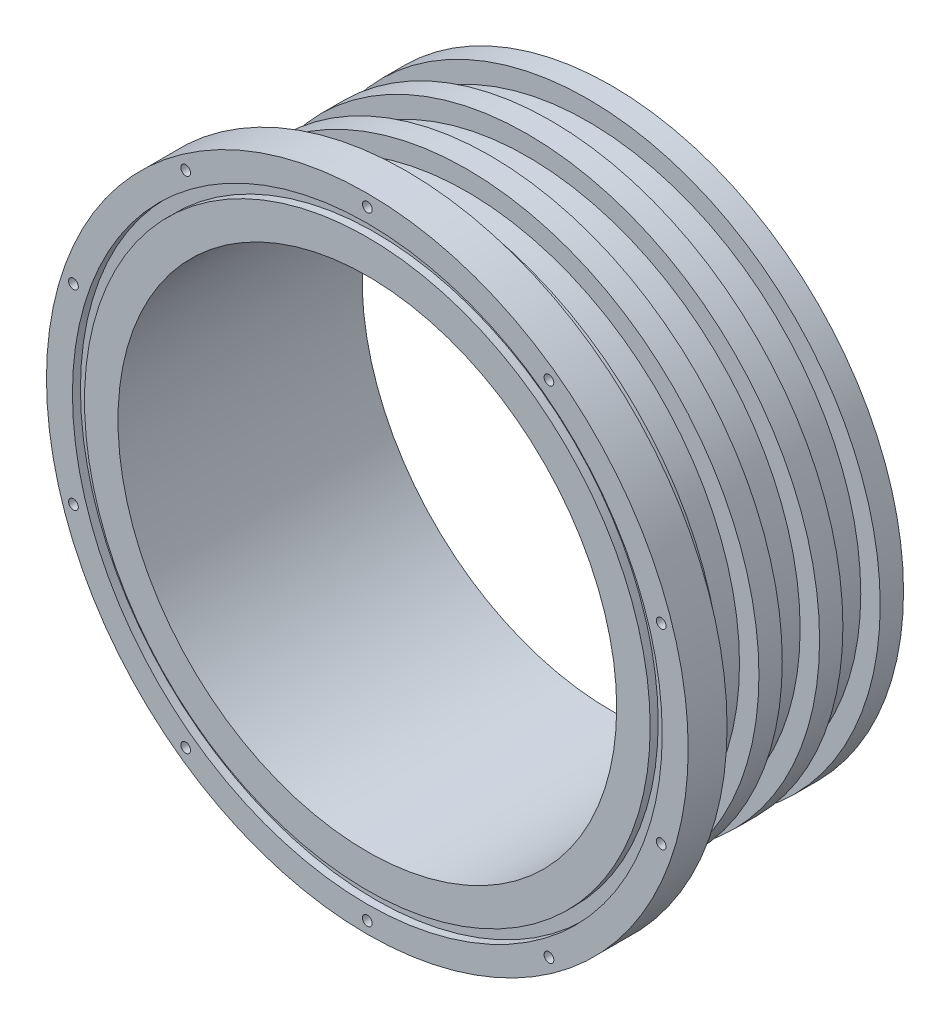
ISO-10303-21;
HEADER;
FILE_DESCRIPTION(('STEP AP214'),'2;1');
FILE_NAME('part.step','',(''),(''),'','','');
FILE_SCHEMA(('AUTOMOTIVE_DESIGN { 1 0 10303 214 1 1 1 1 }'));
ENDSEC;
DATA;
#1=APPLICATION_CONTEXT('core data for automotive mechanical design processes');
#2=APPLICATION_PROTOCOL_DEFINITION('international standard','automotive_design',2000,#1);
#3=PRODUCT_CONTEXT('',#1,'mechanical');
#4=PRODUCT('Part','Part','',(#3));
#5=PRODUCT_RELATED_PRODUCT_CATEGORY('part','',(#4));
#6=PRODUCT_DEFINITION_FORMATION('','',#4);
#7=PRODUCT_DEFINITION_CONTEXT('part definition',#1,'design');
#8=PRODUCT_DEFINITION('design','',#6,#7);
#9=PRODUCT_DEFINITION_SHAPE('','',#8);
#10=(LENGTH_UNIT() NAMED_UNIT(*) SI_UNIT(.MILLI.,.METRE.));
#11=(NAMED_UNIT(*) PLANE_ANGLE_UNIT() SI_UNIT($,.RADIAN.));
#12=(NAMED_UNIT(*) SI_UNIT($,.STERADIAN.) SOLID_ANGLE_UNIT());
#13=UNCERTAINTY_MEASURE_WITH_UNIT(LENGTH_MEASURE(1.E-05),#10,'distance_accuracy_value','');
#14=(GEOMETRIC_REPRESENTATION_CONTEXT(3) GLOBAL_UNCERTAINTY_ASSIGNED_CONTEXT((#13)) GLOBAL_UNIT_ASSIGNED_CONTEXT((#10,
#11,#12)) REPRESENTATION_CONTEXT('',''));
#15=CARTESIAN_POINT('',(0.,0.,0.));
#16=DIRECTION('',(0.,0.,1.));
#17=DIRECTION('',(1.,0.,0.));
#18=AXIS2_PLACEMENT_3D('',#15,#16,#17);
#19=CARTESIAN_POINT('',(-64.15,0.,0.));
#20=DIRECTION('',(0.,0.,-1.));
#21=DIRECTION('',(-1.,0.,0.));
#22=AXIS2_PLACEMENT_3D('',#19,#20,#21);
#23=PLANE('',#22);
#24=CARTESIAN_POINT('',(0.,0.,0.));
#25=DIRECTION('',(0.,0.,1.));
#26=DIRECTION('',(1.,0.,0.));
#27=AXIS2_PLACEMENT_3D('',#24,#25,#26);
#28=CIRCLE('',#27,64.15);
#29=CARTESIAN_POINT('',(64.15,0.,0.));
#30=VERTEX_POINT('',#29);
#31=EDGE_CURVE('E112',#30,#30,#28,.T.);
#32=ORIENTED_EDGE('',*,*,#31,.F.);
#33=EDGE_LOOP('',(#32));
#34=FACE_BOUND('',#33,.T.);
#35=CARTESIAN_POINT('',(0.,0.,0.));
#36=DIRECTION('',(0.,0.,1.));
#37=DIRECTION('',(1.,0.,0.));
#38=AXIS2_PLACEMENT_3D('',#35,#36,#37);
#39=CIRCLE('',#38,72.77);
#40=CARTESIAN_POINT('',(72.77,0.,0.));
#41=VERTEX_POINT('',#40);
#42=EDGE_CURVE('E256',#41,#41,#39,.T.);
#43=ORIENTED_EDGE('',*,*,#42,.T.);
#44=EDGE_LOOP('',(#43));
#45=FACE_BOUND('',#44,.T.);
#46=ADVANCED_FACE('F34',(#34,#45),#23,.F.);
#47=CARTESIAN_POINT('',(0.,0.,0.));
#48=DIRECTION('',(0.,0.,1.));
#49=DIRECTION('',(1.,0.,0.));
#50=AXIS2_PLACEMENT_3D('',#47,#48,#49);
#51=CIRCLE('',#50,75.87);
#52=CARTESIAN_POINT('',(75.87,0.,0.));
#53=VERTEX_POINT('',#52);
#54=EDGE_CURVE('E261',#53,#53,#51,.T.);
#55=ORIENTED_EDGE('',*,*,#54,.F.);
#56=EDGE_LOOP('',(#55));
#57=FACE_BOUND('',#56,.T.);
#58=CARTESIAN_POINT('',(0.,79.5,0.));
#59=DIRECTION('',(0.,0.,1.));
#60=DIRECTION('',(1.,0.,0.));
#61=AXIS2_PLACEMENT_3D('',#58,#59,#60);
#62=CIRCLE('',#61,1.24999999999999);
#63=CARTESIAN_POINT('',(1.24999999999999,79.5,0.));
#64=VERTEX_POINT('',#63);
#65=EDGE_CURVE('E81',#64,#64,#62,.T.);
#66=ORIENTED_EDGE('',*,*,#65,.F.);
#67=EDGE_LOOP('',(#66));
#68=FACE_BOUND('',#67,.T.);
#69=CARTESIAN_POINT('',(46.7289275572529,64.3168510528123,0.));
#70=DIRECTION('',(0.,0.,1.));
#71=DIRECTION('',(1.,0.,0.));
#72=AXIS2_PLACEMENT_3D('',#69,#70,#71);
#73=CIRCLE('',#72,1.24999999999999);
#74=CARTESIAN_POINT('',(47.9789275572529,64.3168510528123,0.));
#75=VERTEX_POINT('',#74);
#76=EDGE_CURVE('E71',#75,#75,#73,.T.);
#77=ORIENTED_EDGE('',*,*,#76,.F.);
#78=EDGE_LOOP('',(#77));
#79=FACE_BOUND('',#78,.T.);
#80=CARTESIAN_POINT('',(75.6089930454694,24.5668510528148,0.));
#81=DIRECTION('',(0.,0.,1.));
#82=DIRECTION('',(1.,0.,0.));
#83=AXIS2_PLACEMENT_3D('',#80,#81,#82);
#84=CIRCLE('',#83,1.24999999999999);
#85=CARTESIAN_POINT('',(76.8589930454694,24.5668510528148,0.));
#86=VERTEX_POINT('',#85);
#87=EDGE_CURVE('E68',#86,#86,#84,.T.);
#88=ORIENTED_EDGE('',*,*,#87,.F.);
#89=EDGE_LOOP('',(#88));
#90=FACE_BOUND('',#89,.T.);
#91=CARTESIAN_POINT('',(75.6089930454736,-24.5668510528019,0.));
#92=DIRECTION('',(0.,0.,1.));
#93=DIRECTION('',(1.,0.,0.));
#94=AXIS2_PLACEMENT_3D('',#91,#92,#93);
#95=CIRCLE('',#94,1.24999999999999);
#96=CARTESIAN_POINT('',(76.8589930454736,-24.5668510528019,0.));
#97=VERTEX_POINT('',#96);
#98=EDGE_CURVE('E65',#97,#97,#95,.T.);
#99=ORIENTED_EDGE('',*,*,#98,.F.);
#100=EDGE_LOOP('',(#99));
#101=FACE_BOUND('',#100,.T.);
#102=CARTESIAN_POINT('',(46.7289275572639,-64.3168510528043,0.));
#103=DIRECTION('',(0.,0.,1.));
#104=DIRECTION('',(1.,0.,0.));
#105=AXIS2_PLACEMENT_3D('',#102,#103,#104);
#106=CIRCLE('',#105,1.24999999999999);
#107=CARTESIAN_POINT('',(47.9789275572639,-64.3168510528043,0.));
#108=VERTEX_POINT('',#107);
#109=EDGE_CURVE('E64',#108,#108,#106,.T.);
#110=ORIENTED_EDGE('',*,*,#109,.F.);
#111=EDGE_LOOP('',(#110));
#112=FACE_BOUND('',#111,.T.);
#113=CARTESIAN_POINT('',(1.35376835141963E-11,-79.5,0.));
#114=DIRECTION('',(0.,0.,1.));
#115=DIRECTION('',(1.,0.,0.));
#116=AXIS2_PLACEMENT_3D('',#113,#114,#115);
#117=CIRCLE('',#116,1.24999999999999);
#118=CARTESIAN_POINT('',(1.25000000001353,-79.5,0.));
#119=VERTEX_POINT('',#118);
#120=EDGE_CURVE('E60',#119,#119,#117,.T.);
#121=ORIENTED_EDGE('',*,*,#120,.F.);
#122=EDGE_LOOP('',(#121));
#123=FACE_BOUND('',#122,.T.);
#124=CARTESIAN_POINT('',(-46.7289275572394,-64.3168510528123,0.));
#125=DIRECTION('',(0.,0.,1.));
#126=DIRECTION('',(1.,0.,0.));
#127=AXIS2_PLACEMENT_3D('',#124,#125,#126);
#128=CIRCLE('',#127,1.24999999999999);
#129=CARTESIAN_POINT('',(-45.4789275572394,-64.3168510528123,0.));
#130=VERTEX_POINT('',#129);
#131=EDGE_CURVE('E59',#130,#130,#128,.T.);
#132=ORIENTED_EDGE('',*,*,#131,.F.);
#133=EDGE_LOOP('',(#132));
#134=FACE_BOUND('',#133,.T.);
#135=CARTESIAN_POINT('',(-75.6089930454558,-24.5668510528148,0.));
#136=DIRECTION('',(0.,0.,1.));
#137=DIRECTION('',(1.,0.,0.));
#138=AXIS2_PLACEMENT_3D('',#135,#136,#137);
#139=CIRCLE('',#138,1.24999999999999);
#140=CARTESIAN_POINT('',(-74.3589930454559,-24.5668510528148,0.));
#141=VERTEX_POINT('',#140);
#142=EDGE_CURVE('E55',#141,#141,#139,.T.);
#143=ORIENTED_EDGE('',*,*,#142,.F.);
#144=EDGE_LOOP('',(#143));
#145=FACE_BOUND('',#144,.T.);
#146=CARTESIAN_POINT('',(-75.60899304546,24.5668510528019,0.));
#147=DIRECTION('',(0.,0.,1.));
#148=DIRECTION('',(1.,0.,0.));
#149=AXIS2_PLACEMENT_3D('',#146,#147,#148);
#150=CIRCLE('',#149,1.24999999999999);
#151=CARTESIAN_POINT('',(-74.3589930454601,24.5668510528019,0.));
#152=VERTEX_POINT('',#151);
#153=EDGE_CURVE('E54',#152,#152,#150,.T.);
#154=ORIENTED_EDGE('',*,*,#153,.F.);
#155=EDGE_LOOP('',(#154));
#156=FACE_BOUND('',#155,.T.);
#157=CARTESIAN_POINT('',(-46.7289275572503,64.3168510528044,0.));
#158=DIRECTION('',(0.,0.,1.));
#159=DIRECTION('',(1.,0.,0.));
#160=AXIS2_PLACEMENT_3D('',#157,#158,#159);
#161=CIRCLE('',#160,1.24999999999999);
#162=CARTESIAN_POINT('',(-45.4789275572503,64.3168510528044,0.));
#163=VERTEX_POINT('',#162);
#164=EDGE_CURVE('E106',#163,#163,#161,.T.);
#165=ORIENTED_EDGE('',*,*,#164,.F.);
#166=EDGE_LOOP('',(#165));
#167=FACE_BOUND('',#166,.T.);
#168=CARTESIAN_POINT('',(0.,0.,0.));
#169=DIRECTION('',(0.,0.,1.));
#170=DIRECTION('',(1.,0.,0.));
#171=AXIS2_PLACEMENT_3D('',#168,#169,#170);
#172=CIRCLE('',#171,82.55);
#173=CARTESIAN_POINT('',(82.55,0.,0.));
#174=VERTEX_POINT('',#173);
#175=EDGE_CURVE('E10',#174,#174,#172,.T.);
#176=ORIENTED_EDGE('',*,*,#175,.T.);
#177=EDGE_LOOP('',(#176));
#178=FACE_BOUND('',#177,.T.);
#179=ADVANCED_FACE('F36',(#57,#68,#79,#90,#101,#112,#123,#134,#145,#156,#167,#178),#23,.F.);
#180=CARTESIAN_POINT('',(0.,0.,0.));
#181=DIRECTION('',(0.,0.,1.));
#182=DIRECTION('',(1.,0.,0.));
#183=AXIS2_PLACEMENT_3D('',#180,#181,#182);
#184=CYLINDRICAL_SURFACE('',#183,82.55);
#185=ORIENTED_EDGE('',*,*,#175,.F.);
#186=EDGE_LOOP('',(#185));
#187=FACE_BOUND('',#186,.T.);
#188=CARTESIAN_POINT('',(0.,0.,-10.));
#189=DIRECTION('',(0.,0.,1.));
#190=DIRECTION('',(1.,0.,0.));
#191=AXIS2_PLACEMENT_3D('',#188,#189,#190);
#192=CIRCLE('',#191,82.55);
#193=CARTESIAN_POINT('',(82.55,0.,-10.));
#194=VERTEX_POINT('',#193);
#195=EDGE_CURVE('E42',#194,#194,#192,.T.);
#196=ORIENTED_EDGE('',*,*,#195,.T.);
#197=EDGE_LOOP('',(#196));
#198=FACE_BOUND('',#197,.T.);
#199=ADVANCED_FACE('F273',(#187,#198),#184,.T.);
#200=CARTESIAN_POINT('',(-82.55,0.,-9.99999999999999));
#201=DIRECTION('',(0.,0.,1.));
#202=DIRECTION('',(1.,0.,0.));
#203=AXIS2_PLACEMENT_3D('',#200,#201,#202);
#204=PLANE('',#203);
#205=CARTESIAN_POINT('',(0.,79.5,-9.99999999999999));
#206=DIRECTION('',(0.,0.,1.));
#207=DIRECTION('',(1.,0.,0.));
#208=AXIS2_PLACEMENT_3D('',#205,#206,#207);
#209=CIRCLE('',#208,1.24999999999999);
#210=CARTESIAN_POINT('',(1.24999999999999,79.5,-9.99999999999999));
#211=VERTEX_POINT('',#210);
#212=EDGE_CURVE('E38',#211,#211,#209,.T.);
#213=ORIENTED_EDGE('',*,*,#212,.T.);
#214=EDGE_LOOP('',(#213));
#215=FACE_BOUND('',#214,.T.);
#216=CARTESIAN_POINT('',(46.7289275572529,64.3168510528123,-9.99999999999999));
#217=DIRECTION('',(0.,0.,1.));
#218=DIRECTION('',(1.,0.,0.));
#219=AXIS2_PLACEMENT_3D('',#216,#217,#218);
#220=CIRCLE('',#219,1.24999999999999);
#221=CARTESIAN_POINT('',(47.9789275572529,64.3168510528123,-9.99999999999999));
#222=VERTEX_POINT('',#221);
#223=EDGE_CURVE('E69',#222,#222,#220,.T.);
#224=ORIENTED_EDGE('',*,*,#223,.T.);
#225=EDGE_LOOP('',(#224));
#226=FACE_BOUND('',#225,.T.);
#227=CARTESIAN_POINT('',(75.6089930454694,24.5668510528148,-9.99999999999999));
#228=DIRECTION('',(0.,0.,1.));
#229=DIRECTION('',(1.,0.,0.));
#230=AXIS2_PLACEMENT_3D('',#227,#228,#229);
#231=CIRCLE('',#230,1.24999999999999);
#232=CARTESIAN_POINT('',(76.8589930454694,24.5668510528148,-9.99999999999999));
#233=VERTEX_POINT('',#232);
#234=EDGE_CURVE('E66',#233,#233,#231,.T.);
#235=ORIENTED_EDGE('',*,*,#234,.T.);
#236=EDGE_LOOP('',(#235));
#237=FACE_BOUND('',#236,.T.);
#238=CARTESIAN_POINT('',(75.6089930454736,-24.5668510528019,-9.99999999999999));
#239=DIRECTION('',(0.,0.,1.));
#240=DIRECTION('',(1.,0.,0.));
#241=AXIS2_PLACEMENT_3D('',#238,#239,#240);
#242=CIRCLE('',#241,1.24999999999999);
#243=CARTESIAN_POINT('',(76.8589930454736,-24.5668510528019,-9.99999999999999));
#244=VERTEX_POINT('',#243);
#245=EDGE_CURVE('E61',#244,#244,#242,.T.);
#246=ORIENTED_EDGE('',*,*,#245,.T.);
#247=EDGE_LOOP('',(#246));
#248=FACE_BOUND('',#247,.T.);
#249=CARTESIAN_POINT('',(46.7289275572639,-64.3168510528043,-9.99999999999999));
#250=DIRECTION('',(0.,0.,1.));
#251=DIRECTION('',(1.,0.,0.));
#252=AXIS2_PLACEMENT_3D('',#249,#250,#251);
#253=CIRCLE('',#252,1.24999999999999);
#254=CARTESIAN_POINT('',(47.9789275572639,-64.3168510528043,-9.99999999999999));
#255=VERTEX_POINT('',#254);
#256=EDGE_CURVE('E89',#255,#255,#253,.T.);
#257=ORIENTED_EDGE('',*,*,#256,.T.);
#258=EDGE_LOOP('',(#257));
#259=FACE_BOUND('',#258,.T.);
#260=CARTESIAN_POINT('',(1.35376835141963E-11,-79.5,-9.99999999999999));
#261=DIRECTION('',(0.,0.,1.));
#262=DIRECTION('',(1.,0.,0.));
#263=AXIS2_PLACEMENT_3D('',#260,#261,#262);
#264=CIRCLE('',#263,1.24999999999999);
#265=CARTESIAN_POINT('',(1.25000000001353,-79.5,-9.99999999999999));
#266=VERTEX_POINT('',#265);
#267=EDGE_CURVE('E56',#266,#266,#264,.T.);
#268=ORIENTED_EDGE('',*,*,#267,.T.);
#269=EDGE_LOOP('',(#268));
#270=FACE_BOUND('',#269,.T.);
#271=CARTESIAN_POINT('',(-46.7289275572394,-64.3168510528123,-9.99999999999999));
#272=DIRECTION('',(0.,0.,1.));
#273=DIRECTION('',(1.,0.,0.));
#274=AXIS2_PLACEMENT_3D('',#271,#272,#273);
#275=CIRCLE('',#274,1.24999999999999);
#276=CARTESIAN_POINT('',(-45.4789275572394,-64.3168510528123,-9.99999999999999));
#277=VERTEX_POINT('',#276);
#278=EDGE_CURVE('E96',#277,#277,#275,.T.);
#279=ORIENTED_EDGE('',*,*,#278,.T.);
#280=EDGE_LOOP('',(#279));
#281=FACE_BOUND('',#280,.T.);
#282=CARTESIAN_POINT('',(-75.6089930454558,-24.5668510528148,-9.99999999999999));
#283=DIRECTION('',(0.,0.,1.));
#284=DIRECTION('',(1.,0.,0.));
#285=AXIS2_PLACEMENT_3D('',#282,#283,#284);
#286=CIRCLE('',#285,1.24999999999999);
#287=CARTESIAN_POINT('',(-74.3589930454559,-24.5668510528148,-9.99999999999999));
#288=VERTEX_POINT('',#287);
#289=EDGE_CURVE('E51',#288,#288,#286,.T.);
#290=ORIENTED_EDGE('',*,*,#289,.T.);
#291=EDGE_LOOP('',(#290));
#292=FACE_BOUND('',#291,.T.);
#293=CARTESIAN_POINT('',(-75.60899304546,24.5668510528019,-9.99999999999999));
#294=DIRECTION('',(0.,0.,1.));
#295=DIRECTION('',(1.,0.,0.));
#296=AXIS2_PLACEMENT_3D('',#293,#294,#295);
#297=CIRCLE('',#296,1.24999999999999);
#298=CARTESIAN_POINT('',(-74.3589930454601,24.5668510528019,-9.99999999999999));
#299=VERTEX_POINT('',#298);
#300=EDGE_CURVE('E103',#299,#299,#297,.T.);
#301=ORIENTED_EDGE('',*,*,#300,.T.);
#302=EDGE_LOOP('',(#301));
#303=FACE_BOUND('',#302,.T.);
#304=CARTESIAN_POINT('',(-46.7289275572503,64.3168510528044,-9.99999999999999));
#305=DIRECTION('',(0.,0.,1.));
#306=DIRECTION('',(1.,0.,0.));
#307=AXIS2_PLACEMENT_3D('',#304,#305,#306);
#308=CIRCLE('',#307,1.24999999999999);
#309=CARTESIAN_POINT('',(-45.4789275572503,64.3168510528044,-9.99999999999999));
#310=VERTEX_POINT('',#309);
#311=EDGE_CURVE('E109',#310,#310,#308,.T.);
#312=ORIENTED_EDGE('',*,*,#311,.T.);
#313=EDGE_LOOP('',(#312));
#314=FACE_BOUND('',#313,.T.);
#315=ORIENTED_EDGE('',*,*,#195,.F.);
#316=EDGE_LOOP('',(#315));
#317=FACE_BOUND('',#316,.T.);
#318=CARTESIAN_POINT('',(0.,0.,-9.99999999999998));
#319=DIRECTION('',(0.,0.,1.));
#320=DIRECTION('',(1.,0.,0.));
#321=AXIS2_PLACEMENT_3D('',#318,#319,#320);
#322=CIRCLE('',#321,75.15);
#323=CARTESIAN_POINT('',(75.15,0.,-9.99999999999998));
#324=VERTEX_POINT('',#323);
#325=EDGE_CURVE('E47',#324,#324,#322,.T.);
#326=ORIENTED_EDGE('',*,*,#325,.T.);
#327=EDGE_LOOP('',(#326));
#328=FACE_BOUND('',#327,.T.);
#329=ADVANCED_FACE('F159',(#215,#226,#237,#248,#259,#270,#281,#292,#303,#314,#317,#328),#204,.F.);
#330=CARTESIAN_POINT('',(0.,0.,0.));
#331=DIRECTION('',(0.,0.,1.));
#332=DIRECTION('',(1.,0.,0.));
#333=AXIS2_PLACEMENT_3D('',#330,#331,#332);
#334=CYLINDRICAL_SURFACE('',#333,75.15);
#335=ORIENTED_EDGE('',*,*,#325,.F.);
#336=EDGE_LOOP('',(#335));
#337=FACE_BOUND('',#336,.T.);
#338=CARTESIAN_POINT('',(0.,0.,-16.));
#339=DIRECTION('',(0.,0.,1.));
#340=DIRECTION('',(1.,0.,0.));
#341=AXIS2_PLACEMENT_3D('',#338,#339,#340);
#342=CIRCLE('',#341,75.15);
#343=CARTESIAN_POINT('',(75.15,0.,-16.));
#344=VERTEX_POINT('',#343);
#345=EDGE_CURVE('E154',#344,#344,#342,.T.);
#346=ORIENTED_EDGE('',*,*,#345,.T.);
#347=EDGE_LOOP('',(#346));
#348=FACE_BOUND('',#347,.T.);
#349=ADVANCED_FACE('F161',(#337,#348),#334,.T.);
#350=CARTESIAN_POINT('',(-75.15,0.,-16.));
#351=DIRECTION('',(0.,0.,1.));
#352=DIRECTION('',(1.,0.,0.));
#353=AXIS2_PLACEMENT_3D('',#350,#351,#352);
#354=PLANE('',#353);
#355=ORIENTED_EDGE('',*,*,#345,.F.);
#356=EDGE_LOOP('',(#355));
#357=FACE_BOUND('',#356,.T.);
#358=CARTESIAN_POINT('',(0.,0.,-16.));
#359=DIRECTION('',(0.,0.,1.));
#360=DIRECTION('',(1.,0.,0.));
#361=AXIS2_PLACEMENT_3D('',#358,#359,#360);
#362=CIRCLE('',#361,70.15);
#363=CARTESIAN_POINT('',(70.15,0.,-16.));
#364=VERTEX_POINT('',#363);
#365=EDGE_CURVE('E151',#364,#364,#362,.T.);
#366=ORIENTED_EDGE('',*,*,#365,.T.);
#367=EDGE_LOOP('',(#366));
#368=FACE_BOUND('',#367,.T.);
#369=ADVANCED_FACE('F164',(#357,#368),#354,.F.);
#370=CARTESIAN_POINT('',(0.,0.,0.));
#371=DIRECTION('',(0.,0.,1.));
#372=DIRECTION('',(1.,0.,0.));
#373=AXIS2_PLACEMENT_3D('',#370,#371,#372);
#374=CYLINDRICAL_SURFACE('',#373,70.15);
#375=ORIENTED_EDGE('',*,*,#365,.F.);
#376=EDGE_LOOP('',(#375));
#377=FACE_BOUND('',#376,.T.);
#378=CARTESIAN_POINT('',(0.,0.,-25.6));
#379=DIRECTION('',(0.,0.,1.));
#380=DIRECTION('',(1.,0.,0.));
#381=AXIS2_PLACEMENT_3D('',#378,#379,#380);
#382=CIRCLE('',#381,70.15);
#383=CARTESIAN_POINT('',(70.15,0.,-25.6));
#384=VERTEX_POINT('',#383);
#385=EDGE_CURVE('E148',#384,#384,#382,.T.);
#386=ORIENTED_EDGE('',*,*,#385,.T.);
#387=EDGE_LOOP('',(#386));
#388=FACE_BOUND('',#387,.T.);
#389=ADVANCED_FACE('F170',(#377,#388),#374,.T.);
#390=CARTESIAN_POINT('',(-70.15,0.,-25.6));
#391=DIRECTION('',(0.,0.,-1.));
#392=DIRECTION('',(-1.,0.,0.));
#393=AXIS2_PLACEMENT_3D('',#390,#391,#392);
#394=PLANE('',#393);
#395=ORIENTED_EDGE('',*,*,#385,.F.);
#396=EDGE_LOOP('',(#395));
#397=FACE_BOUND('',#396,.T.);
#398=CARTESIAN_POINT('',(0.,0.,-25.6));
#399=DIRECTION('',(0.,0.,1.));
#400=DIRECTION('',(1.,0.,0.));
#401=AXIS2_PLACEMENT_3D('',#398,#399,#400);
#402=CIRCLE('',#401,75.15);
#403=CARTESIAN_POINT('',(75.15,0.,-25.6));
#404=VERTEX_POINT('',#403);
#405=EDGE_CURVE('E145',#404,#404,#402,.T.);
#406=ORIENTED_EDGE('',*,*,#405,.T.);
#407=EDGE_LOOP('',(#406));
#408=FACE_BOUND('',#407,.T.);
#409=ADVANCED_FACE('F176',(#397,#408),#394,.F.);
#410=CARTESIAN_POINT('',(0.,0.,0.));
#411=DIRECTION('',(0.,0.,1.));
#412=DIRECTION('',(1.,0.,0.));
#413=AXIS2_PLACEMENT_3D('',#410,#411,#412);
#414=CYLINDRICAL_SURFACE('',#413,75.15);
#415=ORIENTED_EDGE('',*,*,#405,.F.);
#416=EDGE_LOOP('',(#415));
#417=FACE_BOUND('',#416,.T.);
#418=CARTESIAN_POINT('',(0.,0.,-31.6));
#419=DIRECTION('',(0.,0.,1.));
#420=DIRECTION('',(1.,0.,0.));
#421=AXIS2_PLACEMENT_3D('',#418,#419,#420);
#422=CIRCLE('',#421,75.15);
#423=CARTESIAN_POINT('',(75.15,0.,-31.6));
#424=VERTEX_POINT('',#423);
#425=EDGE_CURVE('E142',#424,#424,#422,.T.);
#426=ORIENTED_EDGE('',*,*,#425,.T.);
#427=EDGE_LOOP('',(#426));
#428=FACE_BOUND('',#427,.T.);
#429=ADVANCED_FACE('F182',(#417,#428),#414,.T.);
#430=CARTESIAN_POINT('',(-75.15,0.,-31.6));
#431=DIRECTION('',(0.,0.,1.));
#432=DIRECTION('',(1.,0.,0.));
#433=AXIS2_PLACEMENT_3D('',#430,#431,#432);
#434=PLANE('',#433);
#435=ORIENTED_EDGE('',*,*,#425,.F.);
#436=EDGE_LOOP('',(#435));
#437=FACE_BOUND('',#436,.T.);
#438=CARTESIAN_POINT('',(0.,0.,-31.6));
#439=DIRECTION('',(0.,0.,1.));
#440=DIRECTION('',(1.,0.,0.));
#441=AXIS2_PLACEMENT_3D('',#438,#439,#440);
#442=CIRCLE('',#441,70.15);
#443=CARTESIAN_POINT('',(70.15,0.,-31.6));
#444=VERTEX_POINT('',#443);
#445=EDGE_CURVE('E139',#444,#444,#442,.T.);
#446=ORIENTED_EDGE('',*,*,#445,.T.);
#447=EDGE_LOOP('',(#446));
#448=FACE_BOUND('',#447,.T.);
#449=ADVANCED_FACE('F188',(#437,#448),#434,.F.);
#450=CARTESIAN_POINT('',(0.,0.,0.));
#451=DIRECTION('',(0.,0.,1.));
#452=DIRECTION('',(1.,0.,0.));
#453=AXIS2_PLACEMENT_3D('',#450,#451,#452);
#454=CYLINDRICAL_SURFACE('',#453,70.15);
#455=ORIENTED_EDGE('',*,*,#445,.F.);
#456=EDGE_LOOP('',(#455));
#457=FACE_BOUND('',#456,.T.);
#458=CARTESIAN_POINT('',(0.,0.,-41.2));
#459=DIRECTION('',(0.,0.,1.));
#460=DIRECTION('',(1.,0.,0.));
#461=AXIS2_PLACEMENT_3D('',#458,#459,#460);
#462=CIRCLE('',#461,70.15);
#463=CARTESIAN_POINT('',(70.15,0.,-41.2));
#464=VERTEX_POINT('',#463);
#465=EDGE_CURVE('E136',#464,#464,#462,.T.);
#466=ORIENTED_EDGE('',*,*,#465,.T.);
#467=EDGE_LOOP('',(#466));
#468=FACE_BOUND('',#467,.T.);
#469=ADVANCED_FACE('F194',(#457,#468),#454,.T.);
#470=CARTESIAN_POINT('',(-70.15,0.,-41.2));
#471=DIRECTION('',(0.,0.,-1.));
#472=DIRECTION('',(-1.,0.,0.));
#473=AXIS2_PLACEMENT_3D('',#470,#471,#472);
#474=PLANE('',#473);
#475=ORIENTED_EDGE('',*,*,#465,.F.);
#476=EDGE_LOOP('',(#475));
#477=FACE_BOUND('',#476,.T.);
#478=CARTESIAN_POINT('',(0.,0.,-41.2));
#479=DIRECTION('',(0.,0.,1.));
#480=DIRECTION('',(1.,0.,0.));
#481=AXIS2_PLACEMENT_3D('',#478,#479,#480);
#482=CIRCLE('',#481,75.15);
#483=CARTESIAN_POINT('',(75.15,0.,-41.2));
#484=VERTEX_POINT('',#483);
#485=EDGE_CURVE('E133',#484,#484,#482,.T.);
#486=ORIENTED_EDGE('',*,*,#485,.T.);
#487=EDGE_LOOP('',(#486));
#488=FACE_BOUND('',#487,.T.);
#489=ADVANCED_FACE('F200',(#477,#488),#474,.F.);
#490=CARTESIAN_POINT('',(0.,0.,0.));
#491=DIRECTION('',(0.,0.,1.));
#492=DIRECTION('',(1.,0.,0.));
#493=AXIS2_PLACEMENT_3D('',#490,#491,#492);
#494=CYLINDRICAL_SURFACE('',#493,75.15);
#495=ORIENTED_EDGE('',*,*,#485,.F.);
#496=EDGE_LOOP('',(#495));
#497=FACE_BOUND('',#496,.T.);
#498=CARTESIAN_POINT('',(0.,0.,-47.2));
#499=DIRECTION('',(0.,0.,1.));
#500=DIRECTION('',(1.,0.,0.));
#501=AXIS2_PLACEMENT_3D('',#498,#499,#500);
#502=CIRCLE('',#501,75.15);
#503=CARTESIAN_POINT('',(75.15,0.,-47.2));
#504=VERTEX_POINT('',#503);
#505=EDGE_CURVE('E130',#504,#504,#502,.T.);
#506=ORIENTED_EDGE('',*,*,#505,.T.);
#507=EDGE_LOOP('',(#506));
#508=FACE_BOUND('',#507,.T.);
#509=ADVANCED_FACE('F206',(#497,#508),#494,.T.);
#510=CARTESIAN_POINT('',(-75.15,0.,-47.2));
#511=DIRECTION('',(0.,0.,1.));
#512=DIRECTION('',(1.,0.,0.));
#513=AXIS2_PLACEMENT_3D('',#510,#511,#512);
#514=PLANE('',#513);
#515=ORIENTED_EDGE('',*,*,#505,.F.);
#516=EDGE_LOOP('',(#515));
#517=FACE_BOUND('',#516,.T.);
#518=CARTESIAN_POINT('',(0.,0.,-47.2));
#519=DIRECTION('',(0.,0.,1.));
#520=DIRECTION('',(1.,0.,0.));
#521=AXIS2_PLACEMENT_3D('',#518,#519,#520);
#522=CIRCLE('',#521,70.15);
#523=CARTESIAN_POINT('',(70.15,0.,-47.2));
#524=VERTEX_POINT('',#523);
#525=EDGE_CURVE('E127',#524,#524,#522,.T.);
#526=ORIENTED_EDGE('',*,*,#525,.T.);
#527=EDGE_LOOP('',(#526));
#528=FACE_BOUND('',#527,.T.);
#529=ADVANCED_FACE('F212',(#517,#528),#514,.F.);
#530=CARTESIAN_POINT('',(0.,0.,0.));
#531=DIRECTION('',(0.,0.,1.));
#532=DIRECTION('',(1.,0.,0.));
#533=AXIS2_PLACEMENT_3D('',#530,#531,#532);
#534=CYLINDRICAL_SURFACE('',#533,70.15);
#535=ORIENTED_EDGE('',*,*,#525,.F.);
#536=EDGE_LOOP('',(#535));
#537=FACE_BOUND('',#536,.T.);
#538=CARTESIAN_POINT('',(0.,0.,-56.8));
#539=DIRECTION('',(0.,0.,1.));
#540=DIRECTION('',(1.,0.,0.));
#541=AXIS2_PLACEMENT_3D('',#538,#539,#540);
#542=CIRCLE('',#541,70.15);
#543=CARTESIAN_POINT('',(70.15,0.,-56.8));
#544=VERTEX_POINT('',#543);
#545=EDGE_CURVE('E124',#544,#544,#542,.T.);
#546=ORIENTED_EDGE('',*,*,#545,.T.);
#547=EDGE_LOOP('',(#546));
#548=FACE_BOUND('',#547,.T.);
#549=ADVANCED_FACE('F218',(#537,#548),#534,.T.);
#550=CARTESIAN_POINT('',(-70.15,0.,-56.8));
#551=DIRECTION('',(0.,0.,-1.));
#552=DIRECTION('',(-1.,0.,0.));
#553=AXIS2_PLACEMENT_3D('',#550,#551,#552);
#554=PLANE('',#553);
#555=ORIENTED_EDGE('',*,*,#545,.F.);
#556=EDGE_LOOP('',(#555));
#557=FACE_BOUND('',#556,.T.);
#558=CARTESIAN_POINT('',(0.,0.,-56.8));
#559=DIRECTION('',(0.,0.,1.));
#560=DIRECTION('',(1.,0.,0.));
#561=AXIS2_PLACEMENT_3D('',#558,#559,#560);
#562=CIRCLE('',#561,75.15);
#563=CARTESIAN_POINT('',(75.15,0.,-56.8));
#564=VERTEX_POINT('',#563);
#565=EDGE_CURVE('E121',#564,#564,#562,.T.);
#566=ORIENTED_EDGE('',*,*,#565,.T.);
#567=EDGE_LOOP('',(#566));
#568=FACE_BOUND('',#567,.T.);
#569=ADVANCED_FACE('F224',(#557,#568),#554,.F.);
#570=CARTESIAN_POINT('',(0.,0.,0.));
#571=DIRECTION('',(0.,0.,1.));
#572=DIRECTION('',(1.,0.,0.));
#573=AXIS2_PLACEMENT_3D('',#570,#571,#572);
#574=CYLINDRICAL_SURFACE('',#573,75.15);
#575=ORIENTED_EDGE('',*,*,#565,.F.);
#576=EDGE_LOOP('',(#575));
#577=FACE_BOUND('',#576,.T.);
#578=CARTESIAN_POINT('',(0.,0.,-62.8));
#579=DIRECTION('',(0.,0.,1.));
#580=DIRECTION('',(1.,0.,0.));
#581=AXIS2_PLACEMENT_3D('',#578,#579,#580);
#582=CIRCLE('',#581,75.15);
#583=CARTESIAN_POINT('',(75.15,0.,-62.8));
#584=VERTEX_POINT('',#583);
#585=EDGE_CURVE('E118',#584,#584,#582,.T.);
#586=ORIENTED_EDGE('',*,*,#585,.T.);
#587=EDGE_LOOP('',(#586));
#588=FACE_BOUND('',#587,.T.);
#589=ADVANCED_FACE('F230',(#577,#588),#574,.T.);
#590=CARTESIAN_POINT('',(-75.15,0.,-62.8));
#591=DIRECTION('',(0.,0.,1.));
#592=DIRECTION('',(1.,0.,0.));
#593=AXIS2_PLACEMENT_3D('',#590,#591,#592);
#594=PLANE('',#593);
#595=ORIENTED_EDGE('',*,*,#585,.F.);
#596=EDGE_LOOP('',(#595));
#597=FACE_BOUND('',#596,.T.);
#598=CARTESIAN_POINT('',(0.,0.,-62.8));
#599=DIRECTION('',(0.,0.,1.));
#600=DIRECTION('',(1.,0.,0.));
#601=AXIS2_PLACEMENT_3D('',#598,#599,#600);
#602=CIRCLE('',#601,64.15);
#603=CARTESIAN_POINT('',(64.15,0.,-62.8));
#604=VERTEX_POINT('',#603);
#605=EDGE_CURVE('E115',#604,#604,#602,.T.);
#606=ORIENTED_EDGE('',*,*,#605,.T.);
#607=EDGE_LOOP('',(#606));
#608=FACE_BOUND('',#607,.T.);
#609=ADVANCED_FACE('F236',(#597,#608),#594,.F.);
#610=CARTESIAN_POINT('',(0.,0.,0.));
#611=DIRECTION('',(0.,0.,1.));
#612=DIRECTION('',(1.,0.,0.));
#613=AXIS2_PLACEMENT_3D('',#610,#611,#612);
#614=CYLINDRICAL_SURFACE('',#613,64.15);
#615=ORIENTED_EDGE('',*,*,#605,.F.);
#616=EDGE_LOOP('',(#615));
#617=FACE_BOUND('',#616,.T.);
#618=ORIENTED_EDGE('',*,*,#31,.T.);
#619=EDGE_LOOP('',(#618));
#620=FACE_BOUND('',#619,.T.);
#621=ADVANCED_FACE('F242',(#617,#620),#614,.F.);
#622=CARTESIAN_POINT('',(-46.7289275572503,64.3168510528044,0.));
#623=DIRECTION('',(0.,0.,1.));
#624=DIRECTION('',(1.,0.,0.));
#625=AXIS2_PLACEMENT_3D('',#622,#623,#624);
#626=CYLINDRICAL_SURFACE('',#625,1.24999999999999);
#627=ORIENTED_EDGE('',*,*,#164,.T.);
#628=EDGE_LOOP('',(#627));
#629=FACE_BOUND('',#628,.T.);
#630=ORIENTED_EDGE('',*,*,#311,.F.);
#631=EDGE_LOOP('',(#630));
#632=FACE_BOUND('',#631,.T.);
#633=ADVANCED_FACE('F248',(#629,#632),#626,.F.);
#634=CARTESIAN_POINT('',(-75.60899304546,24.5668510528019,0.));
#635=DIRECTION('',(0.,0.,1.));
#636=DIRECTION('',(1.,0.,0.));
#637=AXIS2_PLACEMENT_3D('',#634,#635,#636);
#638=CYLINDRICAL_SURFACE('',#637,1.24999999999999);
#639=ORIENTED_EDGE('',*,*,#153,.T.);
#640=EDGE_LOOP('',(#639));
#641=FACE_BOUND('',#640,.T.);
#642=ORIENTED_EDGE('',*,*,#300,.F.);
#643=EDGE_LOOP('',(#642));
#644=FACE_BOUND('',#643,.T.);
#645=ADVANCED_FACE('F296',(#641,#644),#638,.F.);
#646=CARTESIAN_POINT('',(-75.6089930454558,-24.5668510528148,0.));
#647=DIRECTION('',(0.,0.,1.));
#648=DIRECTION('',(1.,0.,0.));
#649=AXIS2_PLACEMENT_3D('',#646,#647,#648);
#650=CYLINDRICAL_SURFACE('',#649,1.24999999999999);
#651=ORIENTED_EDGE('',*,*,#142,.T.);
#652=EDGE_LOOP('',(#651));
#653=FACE_BOUND('',#652,.T.);
#654=ORIENTED_EDGE('',*,*,#289,.F.);
#655=EDGE_LOOP('',(#654));
#656=FACE_BOUND('',#655,.T.);
#657=ADVANCED_FACE('F313',(#653,#656),#650,.F.);
#658=CARTESIAN_POINT('',(-46.7289275572394,-64.3168510528123,0.));
#659=DIRECTION('',(0.,0.,1.));
#660=DIRECTION('',(1.,0.,0.));
#661=AXIS2_PLACEMENT_3D('',#658,#659,#660);
#662=CYLINDRICAL_SURFACE('',#661,1.24999999999999);
#663=ORIENTED_EDGE('',*,*,#131,.T.);
#664=EDGE_LOOP('',(#663));
#665=FACE_BOUND('',#664,.T.);
#666=ORIENTED_EDGE('',*,*,#278,.F.);
#667=EDGE_LOOP('',(#666));
#668=FACE_BOUND('',#667,.T.);
#669=ADVANCED_FACE('F317',(#665,#668),#662,.F.);
#670=CARTESIAN_POINT('',(1.35376835141963E-11,-79.5,0.));
#671=DIRECTION('',(0.,0.,1.));
#672=DIRECTION('',(1.,0.,0.));
#673=AXIS2_PLACEMENT_3D('',#670,#671,#672);
#674=CYLINDRICAL_SURFACE('',#673,1.24999999999999);
#675=ORIENTED_EDGE('',*,*,#120,.T.);
#676=EDGE_LOOP('',(#675));
#677=FACE_BOUND('',#676,.T.);
#678=ORIENTED_EDGE('',*,*,#267,.F.);
#679=EDGE_LOOP('',(#678));
#680=FACE_BOUND('',#679,.T.);
#681=ADVANCED_FACE('F321',(#677,#680),#674,.F.);
#682=CARTESIAN_POINT('',(46.7289275572639,-64.3168510528043,0.));
#683=DIRECTION('',(0.,0.,1.));
#684=DIRECTION('',(1.,0.,0.));
#685=AXIS2_PLACEMENT_3D('',#682,#683,#684);
#686=CYLINDRICAL_SURFACE('',#685,1.24999999999999);
#687=ORIENTED_EDGE('',*,*,#109,.T.);
#688=EDGE_LOOP('',(#687));
#689=FACE_BOUND('',#688,.T.);
#690=ORIENTED_EDGE('',*,*,#256,.F.);
#691=EDGE_LOOP('',(#690));
#692=FACE_BOUND('',#691,.T.);
#693=ADVANCED_FACE('F325',(#689,#692),#686,.F.);
#694=CARTESIAN_POINT('',(75.6089930454736,-24.5668510528019,0.));
#695=DIRECTION('',(0.,0.,1.));
#696=DIRECTION('',(1.,0.,0.));
#697=AXIS2_PLACEMENT_3D('',#694,#695,#696);
#698=CYLINDRICAL_SURFACE('',#697,1.24999999999999);
#699=ORIENTED_EDGE('',*,*,#98,.T.);
#700=EDGE_LOOP('',(#699));
#701=FACE_BOUND('',#700,.T.);
#702=ORIENTED_EDGE('',*,*,#245,.F.);
#703=EDGE_LOOP('',(#702));
#704=FACE_BOUND('',#703,.T.);
#705=ADVANCED_FACE('F329',(#701,#704),#698,.F.);
#706=CARTESIAN_POINT('',(75.6089930454694,24.5668510528148,0.));
#707=DIRECTION('',(0.,0.,1.));
#708=DIRECTION('',(1.,0.,0.));
#709=AXIS2_PLACEMENT_3D('',#706,#707,#708);
#710=CYLINDRICAL_SURFACE('',#709,1.24999999999999);
#711=ORIENTED_EDGE('',*,*,#87,.T.);
#712=EDGE_LOOP('',(#711));
#713=FACE_BOUND('',#712,.T.);
#714=ORIENTED_EDGE('',*,*,#234,.F.);
#715=EDGE_LOOP('',(#714));
#716=FACE_BOUND('',#715,.T.);
#717=ADVANCED_FACE('F333',(#713,#716),#710,.F.);
#718=CARTESIAN_POINT('',(46.7289275572529,64.3168510528123,0.));
#719=DIRECTION('',(0.,0.,1.));
#720=DIRECTION('',(1.,0.,0.));
#721=AXIS2_PLACEMENT_3D('',#718,#719,#720);
#722=CYLINDRICAL_SURFACE('',#721,1.24999999999999);
#723=ORIENTED_EDGE('',*,*,#76,.T.);
#724=EDGE_LOOP('',(#723));
#725=FACE_BOUND('',#724,.T.);
#726=ORIENTED_EDGE('',*,*,#223,.F.);
#727=EDGE_LOOP('',(#726));
#728=FACE_BOUND('',#727,.T.);
#729=ADVANCED_FACE('F337',(#725,#728),#722,.F.);
#730=CARTESIAN_POINT('',(0.,79.5,0.));
#731=DIRECTION('',(0.,0.,1.));
#732=DIRECTION('',(1.,0.,0.));
#733=AXIS2_PLACEMENT_3D('',#730,#731,#732);
#734=CYLINDRICAL_SURFACE('',#733,1.24999999999999);
#735=ORIENTED_EDGE('',*,*,#65,.T.);
#736=EDGE_LOOP('',(#735));
#737=FACE_BOUND('',#736,.T.);
#738=ORIENTED_EDGE('',*,*,#212,.F.);
#739=EDGE_LOOP('',(#738));
#740=FACE_BOUND('',#739,.T.);
#741=ADVANCED_FACE('F341',(#737,#740),#734,.F.);
#742=CARTESIAN_POINT('',(0.,0.,-2.06));
#743=DIRECTION('',(0.,0.,1.));
#744=DIRECTION('',(1.,0.,0.));
#745=AXIS2_PLACEMENT_3D('',#742,#743,#744);
#746=CYLINDRICAL_SURFACE('',#745,75.87);
#747=CARTESIAN_POINT('',(0.,0.,-2.06));
#748=DIRECTION('',(0.,0.,1.));
#749=DIRECTION('',(1.,0.,0.));
#750=AXIS2_PLACEMENT_3D('',#747,#748,#749);
#751=CIRCLE('',#750,75.87);
#752=CARTESIAN_POINT('',(75.87,0.,-2.06));
#753=VERTEX_POINT('',#752);
#754=EDGE_CURVE('E264',#753,#753,#751,.T.);
#755=ORIENTED_EDGE('',*,*,#754,.F.);
#756=EDGE_LOOP('',(#755));
#757=FACE_BOUND('',#756,.T.);
#758=ORIENTED_EDGE('',*,*,#54,.T.);
#759=EDGE_LOOP('',(#758));
#760=FACE_BOUND('',#759,.T.);
#761=ADVANCED_FACE('F269',(#757,#760),#746,.F.);
#762=CARTESIAN_POINT('',(0.,0.,-2.06));
#763=DIRECTION('',(0.,0.,1.));
#764=DIRECTION('',(1.,0.,0.));
#765=AXIS2_PLACEMENT_3D('',#762,#763,#764);
#766=PLANE('',#765);
#767=CARTESIAN_POINT('',(0.,0.,-2.06));
#768=DIRECTION('',(0.,0.,1.));
#769=DIRECTION('',(1.,0.,0.));
#770=AXIS2_PLACEMENT_3D('',#767,#768,#769);
#771=CIRCLE('',#770,72.77);
#772=CARTESIAN_POINT('',(72.77,0.,-2.06));
#773=VERTEX_POINT('',#772);
#774=EDGE_CURVE('E258',#773,#773,#771,.T.);
#775=ORIENTED_EDGE('',*,*,#774,.F.);
#776=EDGE_LOOP('',(#775));
#777=FACE_BOUND('',#776,.T.);
#778=ORIENTED_EDGE('',*,*,#754,.T.);
#779=EDGE_LOOP('',(#778));
#780=FACE_BOUND('',#779,.T.);
#781=ADVANCED_FACE('F347',(#777,#780),#766,.T.);
#782=CARTESIAN_POINT('',(0.,0.,-2.06));
#783=DIRECTION('',(0.,0.,1.));
#784=DIRECTION('',(1.,0.,0.));
#785=AXIS2_PLACEMENT_3D('',#782,#783,#784);
#786=CYLINDRICAL_SURFACE('',#785,72.77);
#787=ORIENTED_EDGE('',*,*,#774,.T.);
#788=EDGE_LOOP('',(#787));
#789=FACE_BOUND('',#788,.T.);
#790=ORIENTED_EDGE('',*,*,#42,.F.);
#791=EDGE_LOOP('',(#790));
#792=FACE_BOUND('',#791,.T.);
#793=ADVANCED_FACE('F351',(#789,#792),#786,.T.);
#794=CLOSED_SHELL('',(#46,#179,#199,#329,#349,#369,#389,#409,#429,#449,#469,#489,#509,#529,#549,
#569,#589,#609,#621,#633,#645,#657,#669,#681,#693,#705,#717,#729,#741,#761,#781,#793));
#795=MANIFOLD_SOLID_BREP('B2',#794);
#796=ADVANCED_BREP_SHAPE_REPRESENTATION('',(#18,#795),#14);
#797=SHAPE_DEFINITION_REPRESENTATION(#9,#796);
ENDSEC;
END-ISO-10303-21;
